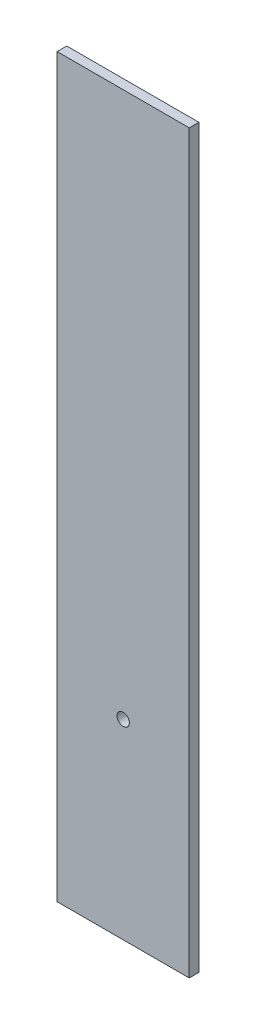
ISO-10303-21;
HEADER;
FILE_DESCRIPTION(('STEP AP214'),'2;1');
FILE_NAME('part.step','',(''),(''),'','','');
FILE_SCHEMA(('AUTOMOTIVE_DESIGN { 1 0 10303 214 1 1 1 1 }'));
ENDSEC;
DATA;
#1=APPLICATION_CONTEXT('core data for automotive mechanical design processes');
#2=APPLICATION_PROTOCOL_DEFINITION('international standard','automotive_design',2000,#1);
#3=PRODUCT_CONTEXT('',#1,'mechanical');
#4=PRODUCT('Part','Part','',(#3));
#5=PRODUCT_RELATED_PRODUCT_CATEGORY('part','',(#4));
#6=PRODUCT_DEFINITION_FORMATION('','',#4);
#7=PRODUCT_DEFINITION_CONTEXT('part definition',#1,'design');
#8=PRODUCT_DEFINITION('design','',#6,#7);
#9=PRODUCT_DEFINITION_SHAPE('','',#8);
#10=(LENGTH_UNIT() NAMED_UNIT(*) SI_UNIT(.MILLI.,.METRE.));
#11=(NAMED_UNIT(*) PLANE_ANGLE_UNIT() SI_UNIT($,.RADIAN.));
#12=(NAMED_UNIT(*) SI_UNIT($,.STERADIAN.) SOLID_ANGLE_UNIT());
#13=UNCERTAINTY_MEASURE_WITH_UNIT(LENGTH_MEASURE(1.E-05),#10,'distance_accuracy_value','');
#14=(GEOMETRIC_REPRESENTATION_CONTEXT(3) GLOBAL_UNCERTAINTY_ASSIGNED_CONTEXT((#13)) GLOBAL_UNIT_ASSIGNED_CONTEXT((#10,
#11,#12)) REPRESENTATION_CONTEXT('',''));
#15=CARTESIAN_POINT('',(0.,0.,0.));
#16=DIRECTION('',(0.,0.,1.));
#17=DIRECTION('',(1.,0.,0.));
#18=AXIS2_PLACEMENT_3D('',#15,#16,#17);
#19=CARTESIAN_POINT('',(0.,0.,4.953));
#20=DIRECTION('',(0.,0.,1.));
#21=DIRECTION('',(1.,0.,0.));
#22=AXIS2_PLACEMENT_3D('',#19,#20,#21);
#23=PLANE('',#22);
#24=DIRECTION('',(0.,-1.,0.));
#25=VECTOR('',#24,1.);
#26=CARTESIAN_POINT('',(-34.0000000000001,394.959461551983,4.953));
#27=LINE('',#26,#25);
#28=CARTESIAN_POINT('',(-34.0000000000001,394.959461551983,4.953));
#29=VERTEX_POINT('',#28);
#30=CARTESIAN_POINT('',(-34.,16.,4.953));
#31=VERTEX_POINT('',#30);
#32=EDGE_CURVE('E85',#29,#31,#27,.T.);
#33=ORIENTED_EDGE('',*,*,#32,.T.);
#34=DIRECTION('',(1.,0.,0.));
#35=VECTOR('',#34,1.);
#36=CARTESIAN_POINT('',(-34.,16.,4.953));
#37=LINE('',#36,#35);
#38=CARTESIAN_POINT('',(34.,16.,4.953));
#39=VERTEX_POINT('',#38);
#40=EDGE_CURVE('E80',#31,#39,#37,.T.);
#41=ORIENTED_EDGE('',*,*,#40,.T.);
#42=DIRECTION('',(0.,1.,0.));
#43=VECTOR('',#42,1.);
#44=CARTESIAN_POINT('',(34.,394.959461551983,4.953));
#45=LINE('',#44,#43);
#46=CARTESIAN_POINT('',(34.,394.959461551983,4.953));
#47=VERTEX_POINT('',#46);
#48=EDGE_CURVE('E83',#39,#47,#45,.T.);
#49=ORIENTED_EDGE('',*,*,#48,.T.);
#50=DIRECTION('',(-1.,0.,0.));
#51=VECTOR('',#50,1.);
#52=CARTESIAN_POINT('',(-34.0000000000001,394.959461551983,4.953));
#53=LINE('',#52,#51);
#54=EDGE_CURVE('E50',#47,#29,#53,.T.);
#55=ORIENTED_EDGE('',*,*,#54,.T.);
#56=EDGE_LOOP('',(#33,#41,#49,#55));
#57=FACE_BOUND('',#56,.T.);
#58=CARTESIAN_POINT('',(0.,114.3,4.953));
#59=DIRECTION('',(0.,0.,1.));
#60=DIRECTION('',(1.,0.,0.));
#61=AXIS2_PLACEMENT_3D('',#58,#59,#60);
#62=CIRCLE('',#61,3.175);
#63=CARTESIAN_POINT('',(3.17499999999997,114.3,4.953));
#64=VERTEX_POINT('',#63);
#65=EDGE_CURVE('E100',#64,#64,#62,.T.);
#66=ORIENTED_EDGE('',*,*,#65,.F.);
#67=EDGE_LOOP('',(#66));
#68=FACE_BOUND('',#67,.T.);
#69=ADVANCED_FACE('F33',(#57,#68),#23,.T.);
#70=CARTESIAN_POINT('',(0.,0.,0.));
#71=DIRECTION('',(0.,0.,1.));
#72=DIRECTION('',(1.,0.,0.));
#73=AXIS2_PLACEMENT_3D('',#70,#71,#72);
#74=PLANE('',#73);
#75=DIRECTION('',(0.,-1.,0.));
#76=VECTOR('',#75,1.);
#77=CARTESIAN_POINT('',(-34.0000000000001,394.959461551983,0.));
#78=LINE('',#77,#76);
#79=CARTESIAN_POINT('',(-34.0000000000001,394.959461551983,0.));
#80=VERTEX_POINT('',#79);
#81=CARTESIAN_POINT('',(-34.,16.,0.));
#82=VERTEX_POINT('',#81);
#83=EDGE_CURVE('E97',#80,#82,#78,.T.);
#84=ORIENTED_EDGE('',*,*,#83,.F.);
#85=DIRECTION('',(-1.,0.,0.));
#86=VECTOR('',#85,1.);
#87=CARTESIAN_POINT('',(-34.0000000000001,394.959461551983,0.));
#88=LINE('',#87,#86);
#89=CARTESIAN_POINT('',(34.,394.959461551983,0.));
#90=VERTEX_POINT('',#89);
#91=EDGE_CURVE('E73',#90,#80,#88,.T.);
#92=ORIENTED_EDGE('',*,*,#91,.F.);
#93=DIRECTION('',(0.,1.,0.));
#94=VECTOR('',#93,1.);
#95=CARTESIAN_POINT('',(34.,394.959461551983,0.));
#96=LINE('',#95,#94);
#97=CARTESIAN_POINT('',(34.,16.,0.));
#98=VERTEX_POINT('',#97);
#99=EDGE_CURVE('E67',#98,#90,#96,.T.);
#100=ORIENTED_EDGE('',*,*,#99,.F.);
#101=DIRECTION('',(1.,0.,0.));
#102=VECTOR('',#101,1.);
#103=CARTESIAN_POINT('',(-34.,16.,0.));
#104=LINE('',#103,#102);
#105=EDGE_CURVE('E89',#82,#98,#104,.T.);
#106=ORIENTED_EDGE('',*,*,#105,.F.);
#107=EDGE_LOOP('',(#84,#92,#100,#106));
#108=FACE_BOUND('',#107,.T.);
#109=CARTESIAN_POINT('',(0.,114.3,0.));
#110=DIRECTION('',(0.,0.,1.));
#111=DIRECTION('',(1.,0.,0.));
#112=AXIS2_PLACEMENT_3D('',#109,#110,#111);
#113=CIRCLE('',#112,3.175);
#114=CARTESIAN_POINT('',(3.17499999999997,114.3,0.));
#115=VERTEX_POINT('',#114);
#116=EDGE_CURVE('E112',#115,#115,#113,.T.);
#117=ORIENTED_EDGE('',*,*,#116,.T.);
#118=EDGE_LOOP('',(#117));
#119=FACE_BOUND('',#118,.T.);
#120=ADVANCED_FACE('F108',(#108,#119),#74,.F.);
#121=CARTESIAN_POINT('',(-34.0000000000001,394.959461551983,4.953));
#122=DIRECTION('',(1.,0.,0.));
#123=DIRECTION('',(0.,1.,0.));
#124=AXIS2_PLACEMENT_3D('',#121,#122,#123);
#125=PLANE('',#124);
#126=ORIENTED_EDGE('',*,*,#83,.T.);
#127=DIRECTION('',(0.,0.,-1.));
#128=VECTOR('',#127,1.);
#129=CARTESIAN_POINT('',(-34.,16.,4.953));
#130=LINE('',#129,#128);
#131=EDGE_CURVE('E11',#31,#82,#130,.T.);
#132=ORIENTED_EDGE('',*,*,#131,.F.);
#133=ORIENTED_EDGE('',*,*,#32,.F.);
#134=DIRECTION('',(0.,0.,-1.));
#135=VECTOR('',#134,1.);
#136=CARTESIAN_POINT('',(-34.0000000000001,394.959461551983,4.953));
#137=LINE('',#136,#135);
#138=EDGE_CURVE('E93',#29,#80,#137,.T.);
#139=ORIENTED_EDGE('',*,*,#138,.T.);
#140=EDGE_LOOP('',(#126,#132,#133,#139));
#141=FACE_BOUND('',#140,.T.);
#142=ADVANCED_FACE('F35',(#141),#125,.F.);
#143=CARTESIAN_POINT('',(-34.,16.,4.953));
#144=DIRECTION('',(0.,1.,0.));
#145=DIRECTION('',(0.,0.,1.));
#146=AXIS2_PLACEMENT_3D('',#143,#144,#145);
#147=PLANE('',#146);
#148=ORIENTED_EDGE('',*,*,#105,.T.);
#149=DIRECTION('',(0.,0.,-1.));
#150=VECTOR('',#149,1.);
#151=CARTESIAN_POINT('',(34.,16.,4.953));
#152=LINE('',#151,#150);
#153=EDGE_CURVE('E42',#39,#98,#152,.T.);
#154=ORIENTED_EDGE('',*,*,#153,.F.);
#155=ORIENTED_EDGE('',*,*,#40,.F.);
#156=ORIENTED_EDGE('',*,*,#131,.T.);
#157=EDGE_LOOP('',(#148,#154,#155,#156));
#158=FACE_BOUND('',#157,.T.);
#159=ADVANCED_FACE('F88',(#158),#147,.F.);
#160=CARTESIAN_POINT('',(34.,394.959461551983,4.953));
#161=DIRECTION('',(-1.,0.,0.));
#162=DIRECTION('',(0.,-1.,0.));
#163=AXIS2_PLACEMENT_3D('',#160,#161,#162);
#164=PLANE('',#163);
#165=ORIENTED_EDGE('',*,*,#99,.T.);
#166=DIRECTION('',(0.,0.,-1.));
#167=VECTOR('',#166,1.);
#168=CARTESIAN_POINT('',(34.,394.959461551983,4.953));
#169=LINE('',#168,#167);
#170=EDGE_CURVE('E90',#47,#90,#169,.T.);
#171=ORIENTED_EDGE('',*,*,#170,.F.);
#172=ORIENTED_EDGE('',*,*,#48,.F.);
#173=ORIENTED_EDGE('',*,*,#153,.T.);
#174=EDGE_LOOP('',(#165,#171,#172,#173));
#175=FACE_BOUND('',#174,.T.);
#176=ADVANCED_FACE('F91',(#175),#164,.F.);
#177=CARTESIAN_POINT('',(-34.0000000000001,394.959461551983,4.953));
#178=DIRECTION('',(0.,-1.,0.));
#179=DIRECTION('',(0.,0.,-1.));
#180=AXIS2_PLACEMENT_3D('',#177,#178,#179);
#181=PLANE('',#180);
#182=ORIENTED_EDGE('',*,*,#91,.T.);
#183=ORIENTED_EDGE('',*,*,#138,.F.);
#184=ORIENTED_EDGE('',*,*,#54,.F.);
#185=ORIENTED_EDGE('',*,*,#170,.T.);
#186=EDGE_LOOP('',(#182,#183,#184,#185));
#187=FACE_BOUND('',#186,.T.);
#188=ADVANCED_FACE('F105',(#187),#181,.F.);
#189=CARTESIAN_POINT('',(0.,114.3,4.953));
#190=DIRECTION('',(0.,0.,-1.));
#191=DIRECTION('',(-1.,0.,0.));
#192=AXIS2_PLACEMENT_3D('',#189,#190,#191);
#193=CYLINDRICAL_SURFACE('',#192,3.175);
#194=ORIENTED_EDGE('',*,*,#65,.T.);
#195=EDGE_LOOP('',(#194));
#196=FACE_BOUND('',#195,.T.);
#197=ORIENTED_EDGE('',*,*,#116,.F.);
#198=EDGE_LOOP('',(#197));
#199=FACE_BOUND('',#198,.T.);
#200=ADVANCED_FACE('F118',(#196,#199),#193,.F.);
#201=CLOSED_SHELL('',(#69,#120,#142,#159,#176,#188,#200));
#202=MANIFOLD_SOLID_BREP('B2',#201);
#203=ADVANCED_BREP_SHAPE_REPRESENTATION('',(#18,#202),#14);
#204=SHAPE_DEFINITION_REPRESENTATION(#9,#203);
ENDSEC;
END-ISO-10303-21;
